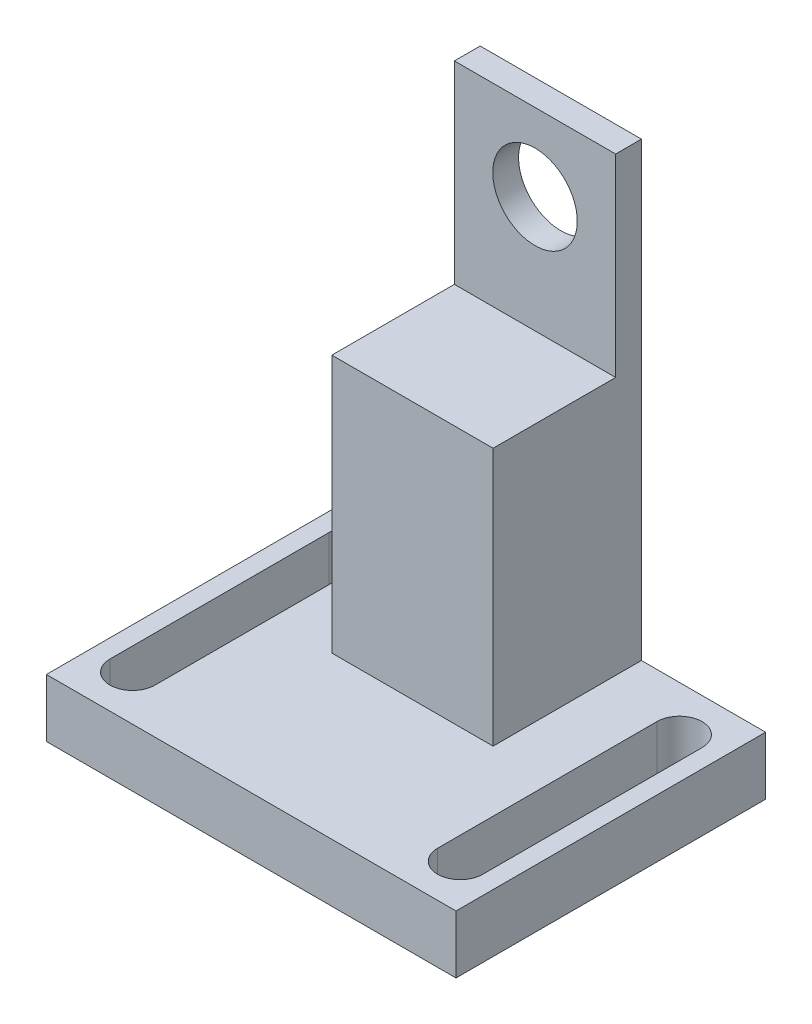
ISO-10303-21;
HEADER;
FILE_DESCRIPTION(('STEP AP214'),'2;1');
FILE_NAME('part.step','',(''),(''),'','','');
FILE_SCHEMA(('AUTOMOTIVE_DESIGN { 1 0 10303 214 1 1 1 1 }'));
ENDSEC;
DATA;
#1=APPLICATION_CONTEXT('core data for automotive mechanical design processes');
#2=APPLICATION_PROTOCOL_DEFINITION('international standard','automotive_design',2000,#1);
#3=PRODUCT_CONTEXT('',#1,'mechanical');
#4=PRODUCT('Part','Part','',(#3));
#5=PRODUCT_RELATED_PRODUCT_CATEGORY('part','',(#4));
#6=PRODUCT_DEFINITION_FORMATION('','',#4);
#7=PRODUCT_DEFINITION_CONTEXT('part definition',#1,'design');
#8=PRODUCT_DEFINITION('design','',#6,#7);
#9=PRODUCT_DEFINITION_SHAPE('','',#8);
#10=(LENGTH_UNIT() NAMED_UNIT(*) SI_UNIT(.MILLI.,.METRE.));
#11=(NAMED_UNIT(*) PLANE_ANGLE_UNIT() SI_UNIT($,.RADIAN.));
#12=(NAMED_UNIT(*) SI_UNIT($,.STERADIAN.) SOLID_ANGLE_UNIT());
#13=UNCERTAINTY_MEASURE_WITH_UNIT(LENGTH_MEASURE(1.E-05),#10,'distance_accuracy_value','');
#14=(GEOMETRIC_REPRESENTATION_CONTEXT(3) GLOBAL_UNCERTAINTY_ASSIGNED_CONTEXT((#13)) GLOBAL_UNIT_ASSIGNED_CONTEXT((#10,
#11,#12)) REPRESENTATION_CONTEXT('',''));
#15=CARTESIAN_POINT('',(0.,0.,0.));
#16=DIRECTION('',(0.,0.,1.));
#17=DIRECTION('',(1.,0.,0.));
#18=AXIS2_PLACEMENT_3D('',#15,#16,#17);
#19=CARTESIAN_POINT('',(-12.5,-58.,11.5));
#20=DIRECTION('',(0.,0.,-1.));
#21=DIRECTION('',(-1.,0.,0.));
#22=AXIS2_PLACEMENT_3D('',#19,#20,#21);
#23=PLANE('',#22);
#24=DIRECTION('',(-1.,0.,0.));
#25=VECTOR('',#24,1.);
#26=CARTESIAN_POINT('',(-31.75,-58.,11.5));
#27=LINE('',#26,#25);
#28=CARTESIAN_POINT('',(12.5,-58.,11.5));
#29=VERTEX_POINT('',#28);
#30=CARTESIAN_POINT('',(-12.5,-58.,11.5));
#31=VERTEX_POINT('',#30);
#32=EDGE_CURVE('E280',#29,#31,#27,.T.);
#33=ORIENTED_EDGE('',*,*,#32,.F.);
#34=DIRECTION('',(0.,1.,0.));
#35=VECTOR('',#34,1.);
#36=CARTESIAN_POINT('',(12.5,12.,11.5));
#37=LINE('',#36,#35);
#38=CARTESIAN_POINT('',(12.5,-18.,11.5));
#39=VERTEX_POINT('',#38);
#40=EDGE_CURVE('E259',#29,#39,#37,.T.);
#41=ORIENTED_EDGE('',*,*,#40,.T.);
#42=DIRECTION('',(-1.,0.,0.));
#43=VECTOR('',#42,1.);
#44=CARTESIAN_POINT('',(31.75,-18.,11.5));
#45=LINE('',#44,#43);
#46=CARTESIAN_POINT('',(-12.5,-18.,11.5));
#47=VERTEX_POINT('',#46);
#48=EDGE_CURVE('E223',#39,#47,#45,.T.);
#49=ORIENTED_EDGE('',*,*,#48,.T.);
#50=DIRECTION('',(0.,-1.,0.));
#51=VECTOR('',#50,1.);
#52=CARTESIAN_POINT('',(-12.5,12.,11.5));
#53=LINE('',#52,#51);
#54=EDGE_CURVE('E255',#47,#31,#53,.T.);
#55=ORIENTED_EDGE('',*,*,#54,.T.);
#56=EDGE_LOOP('',(#33,#41,#49,#55));
#57=FACE_BOUND('',#56,.T.);
#58=ADVANCED_FACE('F32',(#57),#23,.F.);
#59=CARTESIAN_POINT('',(-12.5,-58.,-11.5));
#60=DIRECTION('',(0.,0.,-1.));
#61=DIRECTION('',(-1.,0.,0.));
#62=AXIS2_PLACEMENT_3D('',#59,#60,#61);
#63=PLANE('',#62);
#64=DIRECTION('',(0.,-1.,0.));
#65=VECTOR('',#64,1.);
#66=CARTESIAN_POINT('',(-12.5,12.,-11.5));
#67=LINE('',#66,#65);
#68=CARTESIAN_POINT('',(-12.5,12.,-11.5));
#69=VERTEX_POINT('',#68);
#70=CARTESIAN_POINT('',(-12.5,-58.,-11.5));
#71=VERTEX_POINT('',#70);
#72=EDGE_CURVE('E236',#69,#71,#67,.T.);
#73=ORIENTED_EDGE('',*,*,#72,.F.);
#74=DIRECTION('',(-1.,0.,0.));
#75=VECTOR('',#74,1.);
#76=CARTESIAN_POINT('',(-12.5,12.,-11.5));
#77=LINE('',#76,#75);
#78=CARTESIAN_POINT('',(12.5,12.,-11.5));
#79=VERTEX_POINT('',#78);
#80=EDGE_CURVE('E252',#79,#69,#77,.T.);
#81=ORIENTED_EDGE('',*,*,#80,.F.);
#82=DIRECTION('',(0.,1.,0.));
#83=VECTOR('',#82,1.);
#84=CARTESIAN_POINT('',(12.5,12.,-11.5));
#85=LINE('',#84,#83);
#86=CARTESIAN_POINT('',(12.5,-58.,-11.5));
#87=VERTEX_POINT('',#86);
#88=EDGE_CURVE('E249',#87,#79,#85,.T.);
#89=ORIENTED_EDGE('',*,*,#88,.F.);
#90=DIRECTION('',(-1.,0.,0.));
#91=VECTOR('',#90,1.);
#92=CARTESIAN_POINT('',(12.5,-58.,-11.5));
#93=LINE('',#92,#91);
#94=CARTESIAN_POINT('',(31.75,-58.,-11.5));
#95=VERTEX_POINT('',#94);
#96=EDGE_CURVE('E247',#95,#87,#93,.T.);
#97=ORIENTED_EDGE('',*,*,#96,.F.);
#98=DIRECTION('',(0.,1.,0.));
#99=VECTOR('',#98,1.);
#100=CARTESIAN_POINT('',(31.75,-58.,-11.5));
#101=LINE('',#100,#99);
#102=CARTESIAN_POINT('',(31.75,-67.,-11.5));
#103=VERTEX_POINT('',#102);
#104=EDGE_CURVE('E245',#103,#95,#101,.T.);
#105=ORIENTED_EDGE('',*,*,#104,.F.);
#106=DIRECTION('',(1.,0.,0.));
#107=VECTOR('',#106,1.);
#108=CARTESIAN_POINT('',(-31.75,-67.,-11.5));
#109=LINE('',#108,#107);
#110=CARTESIAN_POINT('',(-31.75,-67.,-11.5));
#111=VERTEX_POINT('',#110);
#112=EDGE_CURVE('E243',#111,#103,#109,.T.);
#113=ORIENTED_EDGE('',*,*,#112,.F.);
#114=DIRECTION('',(0.,-1.,0.));
#115=VECTOR('',#114,1.);
#116=CARTESIAN_POINT('',(-31.75,-58.,-11.5));
#117=LINE('',#116,#115);
#118=CARTESIAN_POINT('',(-31.75,-58.,-11.5));
#119=VERTEX_POINT('',#118);
#120=EDGE_CURVE('E241',#119,#111,#117,.T.);
#121=ORIENTED_EDGE('',*,*,#120,.F.);
#122=DIRECTION('',(-1.,0.,0.));
#123=VECTOR('',#122,1.);
#124=CARTESIAN_POINT('',(-12.5,-58.,-11.5));
#125=LINE('',#124,#123);
#126=EDGE_CURVE('E239',#71,#119,#125,.T.);
#127=ORIENTED_EDGE('',*,*,#126,.F.);
#128=EDGE_LOOP('',(#73,#81,#89,#97,#105,#113,#121,#127));
#129=FACE_BOUND('',#128,.T.);
#130=CARTESIAN_POINT('',(0.,0.,-11.5));
#131=DIRECTION('',(0.,0.,1.));
#132=DIRECTION('',(1.,0.,0.));
#133=AXIS2_PLACEMENT_3D('',#130,#131,#132);
#134=CIRCLE('',#133,6.55);
#135=CARTESIAN_POINT('',(6.55,0.,-11.5));
#136=VERTEX_POINT('',#135);
#137=EDGE_CURVE('E233',#136,#136,#134,.T.);
#138=ORIENTED_EDGE('',*,*,#137,.T.);
#139=EDGE_LOOP('',(#138));
#140=FACE_BOUND('',#139,.T.);
#141=ADVANCED_FACE('F336',(#129,#140),#63,.T.);
#142=CARTESIAN_POINT('',(-12.5,12.,11.5));
#143=DIRECTION('',(1.,0.,0.));
#144=DIRECTION('',(0.,1.,0.));
#145=AXIS2_PLACEMENT_3D('',#142,#143,#144);
#146=PLANE('',#145);
#147=ORIENTED_EDGE('',*,*,#54,.F.);
#148=DIRECTION('',(0.,0.,1.));
#149=VECTOR('',#148,1.);
#150=CARTESIAN_POINT('',(-12.5,-18.,-7.5));
#151=LINE('',#150,#149);
#152=CARTESIAN_POINT('',(-12.5,-18.,-7.5));
#153=VERTEX_POINT('',#152);
#154=EDGE_CURVE('E220',#153,#47,#151,.T.);
#155=ORIENTED_EDGE('',*,*,#154,.F.);
#156=DIRECTION('',(0.,-1.,0.));
#157=VECTOR('',#156,1.);
#158=CARTESIAN_POINT('',(-12.5,12.,-7.5));
#159=LINE('',#158,#157);
#160=CARTESIAN_POINT('',(-12.5,12.,-7.5));
#161=VERTEX_POINT('',#160);
#162=EDGE_CURVE('E217',#161,#153,#159,.T.);
#163=ORIENTED_EDGE('',*,*,#162,.F.);
#164=DIRECTION('',(0.,0.,-1.));
#165=VECTOR('',#164,1.);
#166=CARTESIAN_POINT('',(-12.5,12.,11.5));
#167=LINE('',#166,#165);
#168=EDGE_CURVE('E256',#161,#69,#167,.T.);
#169=ORIENTED_EDGE('',*,*,#168,.T.);
#170=ORIENTED_EDGE('',*,*,#72,.T.);
#171=DIRECTION('',(0.,0.,-1.));
#172=VECTOR('',#171,1.);
#173=CARTESIAN_POINT('',(-12.5,-58.,11.5));
#174=LINE('',#173,#172);
#175=EDGE_CURVE('E274',#31,#71,#174,.T.);
#176=ORIENTED_EDGE('',*,*,#175,.F.);
#177=EDGE_LOOP('',(#147,#155,#163,#169,#170,#176));
#178=FACE_BOUND('',#177,.T.);
#179=ADVANCED_FACE('F34',(#178),#146,.F.);
#180=CARTESIAN_POINT('',(-31.75,-58.,11.5));
#181=DIRECTION('',(1.,0.,0.));
#182=DIRECTION('',(0.,0.,-1.));
#183=AXIS2_PLACEMENT_3D('',#180,#181,#182);
#184=PLANE('',#183);
#185=ORIENTED_EDGE('',*,*,#120,.T.);
#186=DIRECTION('',(0.,0.,-1.));
#187=VECTOR('',#186,1.);
#188=CARTESIAN_POINT('',(-31.75,-67.,11.5));
#189=LINE('',#188,#187);
#190=CARTESIAN_POINT('',(-31.75,-67.,36.5));
#191=VERTEX_POINT('',#190);
#192=EDGE_CURVE('E268',#191,#111,#189,.T.);
#193=ORIENTED_EDGE('',*,*,#192,.F.);
#194=DIRECTION('',(0.,-1.,0.));
#195=VECTOR('',#194,1.);
#196=CARTESIAN_POINT('',(-31.75,-67.,36.5));
#197=LINE('',#196,#195);
#198=CARTESIAN_POINT('',(-31.75,-58.,36.5));
#199=VERTEX_POINT('',#198);
#200=EDGE_CURVE('E199',#199,#191,#197,.T.);
#201=ORIENTED_EDGE('',*,*,#200,.F.);
#202=DIRECTION('',(0.,0.,-1.));
#203=VECTOR('',#202,1.);
#204=CARTESIAN_POINT('',(-31.75,-58.,11.5));
#205=LINE('',#204,#203);
#206=EDGE_CURVE('E271',#199,#119,#205,.T.);
#207=ORIENTED_EDGE('',*,*,#206,.T.);
#208=EDGE_LOOP('',(#185,#193,#201,#207));
#209=FACE_BOUND('',#208,.T.);
#210=ADVANCED_FACE('F363',(#209),#184,.F.);
#211=CARTESIAN_POINT('',(-31.75,-67.,11.5));
#212=DIRECTION('',(0.,1.,0.));
#213=DIRECTION('',(-1.,0.,0.));
#214=AXIS2_PLACEMENT_3D('',#211,#212,#213);
#215=PLANE('',#214);
#216=DIRECTION('',(0.,0.,1.));
#217=VECTOR('',#216,1.);
#218=CARTESIAN_POINT('',(28.9,-67.,-4.5));
#219=LINE('',#218,#217);
#220=CARTESIAN_POINT('',(28.9,-67.,-4.5));
#221=VERTEX_POINT('',#220);
#222=CARTESIAN_POINT('',(28.9,-67.,29.5));
#223=VERTEX_POINT('',#222);
#224=EDGE_CURVE('E169',#221,#223,#219,.T.);
#225=ORIENTED_EDGE('',*,*,#224,.F.);
#226=CARTESIAN_POINT('',(25.4,-67.,-4.5));
#227=DIRECTION('',(0.,-1.,0.));
#228=DIRECTION('',(1.,0.,0.));
#229=AXIS2_PLACEMENT_3D('',#226,#227,#228);
#230=CIRCLE('',#229,3.5);
#231=CARTESIAN_POINT('',(21.9,-67.,-4.5));
#232=VERTEX_POINT('',#231);
#233=EDGE_CURVE('E47',#232,#221,#230,.T.);
#234=ORIENTED_EDGE('',*,*,#233,.F.);
#235=DIRECTION('',(0.,0.,-1.));
#236=VECTOR('',#235,1.);
#237=CARTESIAN_POINT('',(21.9,-67.,-4.5));
#238=LINE('',#237,#236);
#239=CARTESIAN_POINT('',(21.9,-67.,29.5));
#240=VERTEX_POINT('',#239);
#241=EDGE_CURVE('E176',#240,#232,#238,.T.);
#242=ORIENTED_EDGE('',*,*,#241,.F.);
#243=CARTESIAN_POINT('',(25.4,-67.,29.5));
#244=DIRECTION('',(0.,-1.,0.));
#245=DIRECTION('',(1.,0.,0.));
#246=AXIS2_PLACEMENT_3D('',#243,#244,#245);
#247=CIRCLE('',#246,3.5);
#248=EDGE_CURVE('E160',#223,#240,#247,.T.);
#249=ORIENTED_EDGE('',*,*,#248,.F.);
#250=EDGE_LOOP('',(#225,#234,#242,#249));
#251=FACE_BOUND('',#250,.T.);
#252=DIRECTION('',(0.,0.,-1.));
#253=VECTOR('',#252,1.);
#254=CARTESIAN_POINT('',(-28.9,-67.,29.5));
#255=LINE('',#254,#253);
#256=CARTESIAN_POINT('',(-28.9,-67.,29.5));
#257=VERTEX_POINT('',#256);
#258=CARTESIAN_POINT('',(-28.9,-67.,-4.5));
#259=VERTEX_POINT('',#258);
#260=EDGE_CURVE('E187',#257,#259,#255,.T.);
#261=ORIENTED_EDGE('',*,*,#260,.F.);
#262=CARTESIAN_POINT('',(-25.4,-67.,29.5));
#263=DIRECTION('',(0.,-1.,0.));
#264=DIRECTION('',(1.,0.,0.));
#265=AXIS2_PLACEMENT_3D('',#262,#263,#264);
#266=CIRCLE('',#265,3.5);
#267=CARTESIAN_POINT('',(-21.9,-67.,29.5));
#268=VERTEX_POINT('',#267);
#269=EDGE_CURVE('E183',#268,#257,#266,.T.);
#270=ORIENTED_EDGE('',*,*,#269,.F.);
#271=DIRECTION('',(0.,0.,1.));
#272=VECTOR('',#271,1.);
#273=CARTESIAN_POINT('',(-21.9,-67.,29.5));
#274=LINE('',#273,#272);
#275=CARTESIAN_POINT('',(-21.9,-67.,-4.5));
#276=VERTEX_POINT('',#275);
#277=EDGE_CURVE('E193',#276,#268,#274,.T.);
#278=ORIENTED_EDGE('',*,*,#277,.F.);
#279=CARTESIAN_POINT('',(-25.4,-67.,-4.5));
#280=DIRECTION('',(0.,-1.,0.));
#281=DIRECTION('',(1.,0.,0.));
#282=AXIS2_PLACEMENT_3D('',#279,#280,#281);
#283=CIRCLE('',#282,3.5);
#284=EDGE_CURVE('E190',#259,#276,#283,.T.);
#285=ORIENTED_EDGE('',*,*,#284,.F.);
#286=EDGE_LOOP('',(#261,#270,#278,#285));
#287=FACE_BOUND('',#286,.T.);
#288=ORIENTED_EDGE('',*,*,#112,.T.);
#289=DIRECTION('',(0.,0.,-1.));
#290=VECTOR('',#289,1.);
#291=CARTESIAN_POINT('',(31.75,-67.,11.5));
#292=LINE('',#291,#290);
#293=CARTESIAN_POINT('',(31.75,-67.,36.5));
#294=VERTEX_POINT('',#293);
#295=EDGE_CURVE('E265',#294,#103,#292,.T.);
#296=ORIENTED_EDGE('',*,*,#295,.F.);
#297=DIRECTION('',(1.,0.,0.));
#298=VECTOR('',#297,1.);
#299=CARTESIAN_POINT('',(-31.75,-67.,36.5));
#300=LINE('',#299,#298);
#301=EDGE_CURVE('E208',#191,#294,#300,.T.);
#302=ORIENTED_EDGE('',*,*,#301,.F.);
#303=ORIENTED_EDGE('',*,*,#192,.T.);
#304=EDGE_LOOP('',(#288,#296,#302,#303));
#305=FACE_BOUND('',#304,.T.);
#306=ADVANCED_FACE('F173',(#251,#287,#305),#215,.F.);
#307=CARTESIAN_POINT('',(31.75,-58.,11.5));
#308=DIRECTION('',(-1.,0.,0.));
#309=DIRECTION('',(0.,0.,1.));
#310=AXIS2_PLACEMENT_3D('',#307,#308,#309);
#311=PLANE('',#310);
#312=ORIENTED_EDGE('',*,*,#104,.T.);
#313=DIRECTION('',(0.,0.,-1.));
#314=VECTOR('',#313,1.);
#315=CARTESIAN_POINT('',(31.75,-58.,11.5));
#316=LINE('',#315,#314);
#317=CARTESIAN_POINT('',(31.75,-58.,36.5));
#318=VERTEX_POINT('',#317);
#319=EDGE_CURVE('E262',#318,#95,#316,.T.);
#320=ORIENTED_EDGE('',*,*,#319,.F.);
#321=DIRECTION('',(0.,1.,0.));
#322=VECTOR('',#321,1.);
#323=CARTESIAN_POINT('',(31.75,-67.,36.5));
#324=LINE('',#323,#322);
#325=EDGE_CURVE('E211',#294,#318,#324,.T.);
#326=ORIENTED_EDGE('',*,*,#325,.F.);
#327=ORIENTED_EDGE('',*,*,#295,.T.);
#328=EDGE_LOOP('',(#312,#320,#326,#327));
#329=FACE_BOUND('',#328,.T.);
#330=ADVANCED_FACE('F358',(#329),#311,.F.);
#331=CARTESIAN_POINT('',(12.5,-58.,11.5));
#332=DIRECTION('',(0.,-1.,0.));
#333=DIRECTION('',(0.,0.,-1.));
#334=AXIS2_PLACEMENT_3D('',#331,#332,#333);
#335=PLANE('',#334);
#336=DIRECTION('',(0.,0.,-1.));
#337=VECTOR('',#336,1.);
#338=CARTESIAN_POINT('',(21.9,-58.,11.5));
#339=LINE('',#338,#337);
#340=CARTESIAN_POINT('',(21.9,-58.,29.5));
#341=VERTEX_POINT('',#340);
#342=CARTESIAN_POINT('',(21.9,-58.,-4.5));
#343=VERTEX_POINT('',#342);
#344=EDGE_CURVE('E40',#341,#343,#339,.T.);
#345=ORIENTED_EDGE('',*,*,#344,.T.);
#346=CARTESIAN_POINT('',(25.4,-58.,-4.5));
#347=DIRECTION('',(0.,-1.,0.));
#348=DIRECTION('',(0.,0.,-1.));
#349=AXIS2_PLACEMENT_3D('',#346,#347,#348);
#350=CIRCLE('',#349,3.5);
#351=CARTESIAN_POINT('',(28.9,-58.,-4.5));
#352=VERTEX_POINT('',#351);
#353=EDGE_CURVE('E11',#343,#352,#350,.T.);
#354=ORIENTED_EDGE('',*,*,#353,.T.);
#355=DIRECTION('',(0.,0.,1.));
#356=VECTOR('',#355,1.);
#357=CARTESIAN_POINT('',(28.9,-58.,11.5));
#358=LINE('',#357,#356);
#359=CARTESIAN_POINT('',(28.9,-58.,29.5));
#360=VERTEX_POINT('',#359);
#361=EDGE_CURVE('E312',#352,#360,#358,.T.);
#362=ORIENTED_EDGE('',*,*,#361,.T.);
#363=CARTESIAN_POINT('',(25.4,-58.,29.5));
#364=DIRECTION('',(0.,-1.,0.));
#365=DIRECTION('',(0.,0.,-1.));
#366=AXIS2_PLACEMENT_3D('',#363,#364,#365);
#367=CIRCLE('',#366,3.5);
#368=EDGE_CURVE('E163',#360,#341,#367,.T.);
#369=ORIENTED_EDGE('',*,*,#368,.T.);
#370=EDGE_LOOP('',(#345,#354,#362,#369));
#371=FACE_BOUND('',#370,.T.);
#372=DIRECTION('',(0.,0.,1.));
#373=VECTOR('',#372,1.);
#374=CARTESIAN_POINT('',(-21.9,-58.,11.5));
#375=LINE('',#374,#373);
#376=CARTESIAN_POINT('',(-21.9,-58.,-4.5));
#377=VERTEX_POINT('',#376);
#378=CARTESIAN_POINT('',(-21.9,-58.,29.5));
#379=VERTEX_POINT('',#378);
#380=EDGE_CURVE('E306',#377,#379,#375,.T.);
#381=ORIENTED_EDGE('',*,*,#380,.T.);
#382=CARTESIAN_POINT('',(-25.4,-58.,29.5));
#383=DIRECTION('',(0.,-1.,0.));
#384=DIRECTION('',(0.,0.,-1.));
#385=AXIS2_PLACEMENT_3D('',#382,#383,#384);
#386=CIRCLE('',#385,3.5);
#387=CARTESIAN_POINT('',(-28.9,-58.,29.5));
#388=VERTEX_POINT('',#387);
#389=EDGE_CURVE('E309',#379,#388,#386,.T.);
#390=ORIENTED_EDGE('',*,*,#389,.T.);
#391=DIRECTION('',(0.,0.,-1.));
#392=VECTOR('',#391,1.);
#393=CARTESIAN_POINT('',(-28.9,-58.,11.5));
#394=LINE('',#393,#392);
#395=CARTESIAN_POINT('',(-28.9,-58.,-4.5));
#396=VERTEX_POINT('',#395);
#397=EDGE_CURVE('E285',#388,#396,#394,.T.);
#398=ORIENTED_EDGE('',*,*,#397,.T.);
#399=CARTESIAN_POINT('',(-25.4,-58.,-4.5));
#400=DIRECTION('',(0.,-1.,0.));
#401=DIRECTION('',(0.,0.,-1.));
#402=AXIS2_PLACEMENT_3D('',#399,#400,#401);
#403=CIRCLE('',#402,3.5);
#404=EDGE_CURVE('E303',#396,#377,#403,.T.);
#405=ORIENTED_EDGE('',*,*,#404,.T.);
#406=EDGE_LOOP('',(#381,#390,#398,#405));
#407=FACE_BOUND('',#406,.T.);
#408=ORIENTED_EDGE('',*,*,#96,.T.);
#409=DIRECTION('',(0.,0.,-1.));
#410=VECTOR('',#409,1.);
#411=CARTESIAN_POINT('',(12.5,-58.,11.5));
#412=LINE('',#411,#410);
#413=EDGE_CURVE('E261',#29,#87,#412,.T.);
#414=ORIENTED_EDGE('',*,*,#413,.F.);
#415=ORIENTED_EDGE('',*,*,#32,.T.);
#416=ORIENTED_EDGE('',*,*,#175,.T.);
#417=ORIENTED_EDGE('',*,*,#126,.T.);
#418=ORIENTED_EDGE('',*,*,#206,.F.);
#419=DIRECTION('',(-1.,0.,0.));
#420=VECTOR('',#419,1.);
#421=CARTESIAN_POINT('',(-31.75,-58.,36.5));
#422=LINE('',#421,#420);
#423=EDGE_CURVE('E214',#318,#199,#422,.T.);
#424=ORIENTED_EDGE('',*,*,#423,.F.);
#425=ORIENTED_EDGE('',*,*,#319,.T.);
#426=EDGE_LOOP('',(#408,#414,#415,#416,#417,#418,#424,#425));
#427=FACE_BOUND('',#426,.T.);
#428=ADVANCED_FACE('F316',(#371,#407,#427),#335,.F.);
#429=CARTESIAN_POINT('',(12.5,12.,11.5));
#430=DIRECTION('',(-1.,0.,0.));
#431=DIRECTION('',(0.,-1.,0.));
#432=AXIS2_PLACEMENT_3D('',#429,#430,#431);
#433=PLANE('',#432);
#434=DIRECTION('',(0.,-1.,0.));
#435=VECTOR('',#434,1.);
#436=CARTESIAN_POINT('',(12.5,12.,-7.5));
#437=LINE('',#436,#435);
#438=CARTESIAN_POINT('',(12.5,12.,-7.5));
#439=VERTEX_POINT('',#438);
#440=CARTESIAN_POINT('',(12.5,-18.,-7.5));
#441=VERTEX_POINT('',#440);
#442=EDGE_CURVE('E230',#439,#441,#437,.T.);
#443=ORIENTED_EDGE('',*,*,#442,.T.);
#444=DIRECTION('',(0.,0.,1.));
#445=VECTOR('',#444,1.);
#446=CARTESIAN_POINT('',(12.5,-18.,11.5));
#447=LINE('',#446,#445);
#448=EDGE_CURVE('E277',#441,#39,#447,.T.);
#449=ORIENTED_EDGE('',*,*,#448,.T.);
#450=ORIENTED_EDGE('',*,*,#40,.F.);
#451=ORIENTED_EDGE('',*,*,#413,.T.);
#452=ORIENTED_EDGE('',*,*,#88,.T.);
#453=DIRECTION('',(0.,0.,-1.));
#454=VECTOR('',#453,1.);
#455=CARTESIAN_POINT('',(12.5,12.,11.5));
#456=LINE('',#455,#454);
#457=EDGE_CURVE('E258',#439,#79,#456,.T.);
#458=ORIENTED_EDGE('',*,*,#457,.F.);
#459=EDGE_LOOP('',(#443,#449,#450,#451,#452,#458));
#460=FACE_BOUND('',#459,.T.);
#461=ADVANCED_FACE('F351',(#460),#433,.F.);
#462=CARTESIAN_POINT('',(-12.5,12.,11.5));
#463=DIRECTION('',(0.,-1.,0.));
#464=DIRECTION('',(1.,0.,0.));
#465=AXIS2_PLACEMENT_3D('',#462,#463,#464);
#466=PLANE('',#465);
#467=ORIENTED_EDGE('',*,*,#168,.F.);
#468=DIRECTION('',(-1.,0.,0.));
#469=VECTOR('',#468,1.);
#470=CARTESIAN_POINT('',(31.75,12.,-7.5));
#471=LINE('',#470,#469);
#472=EDGE_CURVE('E222',#439,#161,#471,.T.);
#473=ORIENTED_EDGE('',*,*,#472,.F.);
#474=ORIENTED_EDGE('',*,*,#457,.T.);
#475=ORIENTED_EDGE('',*,*,#80,.T.);
#476=EDGE_LOOP('',(#467,#473,#474,#475));
#477=FACE_BOUND('',#476,.T.);
#478=ADVANCED_FACE('F348',(#477),#466,.F.);
#479=CARTESIAN_POINT('',(0.,0.,11.5));
#480=DIRECTION('',(0.,0.,-1.));
#481=DIRECTION('',(-1.,0.,0.));
#482=AXIS2_PLACEMENT_3D('',#479,#480,#481);
#483=CYLINDRICAL_SURFACE('',#482,6.55);
#484=CARTESIAN_POINT('',(0.,0.,-7.5));
#485=DIRECTION('',(0.,0.,-1.));
#486=DIRECTION('',(0.,1.,0.));
#487=AXIS2_PLACEMENT_3D('',#484,#485,#486);
#488=CIRCLE('',#487,6.55);
#489=CARTESIAN_POINT('',(0.,6.55,-7.5));
#490=VERTEX_POINT('',#489);
#491=EDGE_CURVE('E226',#490,#490,#488,.T.);
#492=ORIENTED_EDGE('',*,*,#491,.F.);
#493=EDGE_LOOP('',(#492));
#494=FACE_BOUND('',#493,.T.);
#495=ORIENTED_EDGE('',*,*,#137,.F.);
#496=EDGE_LOOP('',(#495));
#497=FACE_BOUND('',#496,.T.);
#498=ADVANCED_FACE('F345',(#494,#497),#483,.F.);
#499=CARTESIAN_POINT('',(31.75,-18.,-7.5));
#500=DIRECTION('',(0.,-1.,0.));
#501=DIRECTION('',(0.,0.,-1.));
#502=AXIS2_PLACEMENT_3D('',#499,#500,#501);
#503=PLANE('',#502);
#504=DIRECTION('',(-1.,0.,0.));
#505=VECTOR('',#504,1.);
#506=CARTESIAN_POINT('',(31.75,-18.,-7.5));
#507=LINE('',#506,#505);
#508=EDGE_CURVE('E227',#441,#153,#507,.T.);
#509=ORIENTED_EDGE('',*,*,#508,.T.);
#510=ORIENTED_EDGE('',*,*,#154,.T.);
#511=ORIENTED_EDGE('',*,*,#48,.F.);
#512=ORIENTED_EDGE('',*,*,#448,.F.);
#513=EDGE_LOOP('',(#509,#510,#511,#512));
#514=FACE_BOUND('',#513,.T.);
#515=ADVANCED_FACE('F397',(#514),#503,.F.);
#516=CARTESIAN_POINT('',(31.75,12.,-7.5));
#517=DIRECTION('',(0.,0.,-1.));
#518=DIRECTION('',(0.,1.,0.));
#519=AXIS2_PLACEMENT_3D('',#516,#517,#518);
#520=PLANE('',#519);
#521=ORIENTED_EDGE('',*,*,#491,.T.);
#522=EDGE_LOOP('',(#521));
#523=FACE_BOUND('',#522,.T.);
#524=ORIENTED_EDGE('',*,*,#472,.T.);
#525=ORIENTED_EDGE('',*,*,#162,.T.);
#526=ORIENTED_EDGE('',*,*,#508,.F.);
#527=ORIENTED_EDGE('',*,*,#442,.F.);
#528=EDGE_LOOP('',(#524,#525,#526,#527));
#529=FACE_BOUND('',#528,.T.);
#530=ADVANCED_FACE('F388',(#523,#529),#520,.F.);
#531=CARTESIAN_POINT('',(-31.75,-58.,36.5));
#532=DIRECTION('',(0.,0.,-1.));
#533=DIRECTION('',(-1.,0.,0.));
#534=AXIS2_PLACEMENT_3D('',#531,#532,#533);
#535=PLANE('',#534);
#536=ORIENTED_EDGE('',*,*,#200,.T.);
#537=ORIENTED_EDGE('',*,*,#301,.T.);
#538=ORIENTED_EDGE('',*,*,#325,.T.);
#539=ORIENTED_EDGE('',*,*,#423,.T.);
#540=EDGE_LOOP('',(#536,#537,#538,#539));
#541=FACE_BOUND('',#540,.T.);
#542=ADVANCED_FACE('F385',(#541),#535,.F.);
#543=CARTESIAN_POINT('',(-25.4,12.,29.5));
#544=DIRECTION('',(0.,-1.,0.));
#545=DIRECTION('',(1.,0.,0.));
#546=AXIS2_PLACEMENT_3D('',#543,#544,#545);
#547=CYLINDRICAL_SURFACE('',#546,3.5);
#548=DIRECTION('',(0.,-1.,0.));
#549=VECTOR('',#548,1.);
#550=CARTESIAN_POINT('',(-21.9,12.,29.5));
#551=LINE('',#550,#549);
#552=EDGE_CURVE('E197',#379,#268,#551,.T.);
#553=ORIENTED_EDGE('',*,*,#552,.T.);
#554=ORIENTED_EDGE('',*,*,#269,.T.);
#555=DIRECTION('',(0.,-1.,0.));
#556=VECTOR('',#555,1.);
#557=CARTESIAN_POINT('',(-28.9,12.,29.5));
#558=LINE('',#557,#556);
#559=EDGE_CURVE('E196',#388,#257,#558,.T.);
#560=ORIENTED_EDGE('',*,*,#559,.F.);
#561=ORIENTED_EDGE('',*,*,#389,.F.);
#562=EDGE_LOOP('',(#553,#554,#560,#561));
#563=FACE_BOUND('',#562,.T.);
#564=ADVANCED_FACE('F387',(#563),#547,.F.);
#565=CARTESIAN_POINT('',(-21.9,12.,29.5));
#566=DIRECTION('',(1.,0.,0.));
#567=DIRECTION('',(0.,0.,-1.));
#568=AXIS2_PLACEMENT_3D('',#565,#566,#567);
#569=PLANE('',#568);
#570=DIRECTION('',(0.,-1.,0.));
#571=VECTOR('',#570,1.);
#572=CARTESIAN_POINT('',(-21.9,12.,-4.5));
#573=LINE('',#572,#571);
#574=EDGE_CURVE('E200',#377,#276,#573,.T.);
#575=ORIENTED_EDGE('',*,*,#574,.T.);
#576=ORIENTED_EDGE('',*,*,#277,.T.);
#577=ORIENTED_EDGE('',*,*,#552,.F.);
#578=ORIENTED_EDGE('',*,*,#380,.F.);
#579=EDGE_LOOP('',(#575,#576,#577,#578));
#580=FACE_BOUND('',#579,.T.);
#581=ADVANCED_FACE('F394',(#580),#569,.F.);
#582=CARTESIAN_POINT('',(-25.4,12.,-4.5));
#583=DIRECTION('',(0.,-1.,0.));
#584=DIRECTION('',(1.,0.,0.));
#585=AXIS2_PLACEMENT_3D('',#582,#583,#584);
#586=CYLINDRICAL_SURFACE('',#585,3.5);
#587=DIRECTION('',(0.,-1.,0.));
#588=VECTOR('',#587,1.);
#589=CARTESIAN_POINT('',(-28.9,12.,-4.5));
#590=LINE('',#589,#588);
#591=EDGE_CURVE('E202',#396,#259,#590,.T.);
#592=ORIENTED_EDGE('',*,*,#591,.T.);
#593=ORIENTED_EDGE('',*,*,#284,.T.);
#594=ORIENTED_EDGE('',*,*,#574,.F.);
#595=ORIENTED_EDGE('',*,*,#404,.F.);
#596=EDGE_LOOP('',(#592,#593,#594,#595));
#597=FACE_BOUND('',#596,.T.);
#598=ADVANCED_FACE('F330',(#597),#586,.F.);
#599=CARTESIAN_POINT('',(-28.9,12.,29.5));
#600=DIRECTION('',(-1.,0.,0.));
#601=DIRECTION('',(0.,0.,1.));
#602=AXIS2_PLACEMENT_3D('',#599,#600,#601);
#603=PLANE('',#602);
#604=ORIENTED_EDGE('',*,*,#559,.T.);
#605=ORIENTED_EDGE('',*,*,#260,.T.);
#606=ORIENTED_EDGE('',*,*,#591,.F.);
#607=ORIENTED_EDGE('',*,*,#397,.F.);
#608=EDGE_LOOP('',(#604,#605,#606,#607));
#609=FACE_BOUND('',#608,.T.);
#610=ADVANCED_FACE('F323',(#609),#603,.F.);
#611=CARTESIAN_POINT('',(25.4,12.,-4.5));
#612=DIRECTION('',(0.,-1.,0.));
#613=DIRECTION('',(1.,0.,0.));
#614=AXIS2_PLACEMENT_3D('',#611,#612,#613);
#615=CYLINDRICAL_SURFACE('',#614,3.5);
#616=DIRECTION('',(0.,-1.,0.));
#617=VECTOR('',#616,1.);
#618=CARTESIAN_POINT('',(21.9,12.,-4.5));
#619=LINE('',#618,#617);
#620=EDGE_CURVE('E181',#343,#232,#619,.T.);
#621=ORIENTED_EDGE('',*,*,#620,.T.);
#622=ORIENTED_EDGE('',*,*,#233,.T.);
#623=DIRECTION('',(0.,-1.,0.));
#624=VECTOR('',#623,1.);
#625=CARTESIAN_POINT('',(28.9,12.,-4.5));
#626=LINE('',#625,#624);
#627=EDGE_CURVE('E166',#352,#221,#626,.T.);
#628=ORIENTED_EDGE('',*,*,#627,.F.);
#629=ORIENTED_EDGE('',*,*,#353,.F.);
#630=EDGE_LOOP('',(#621,#622,#628,#629));
#631=FACE_BOUND('',#630,.T.);
#632=ADVANCED_FACE('F321',(#631),#615,.F.);
#633=CARTESIAN_POINT('',(21.9,12.,-4.5));
#634=DIRECTION('',(-1.,0.,0.));
#635=DIRECTION('',(0.,0.,1.));
#636=AXIS2_PLACEMENT_3D('',#633,#634,#635);
#637=PLANE('',#636);
#638=DIRECTION('',(0.,-1.,0.));
#639=VECTOR('',#638,1.);
#640=CARTESIAN_POINT('',(21.9,12.,29.5));
#641=LINE('',#640,#639);
#642=EDGE_CURVE('E165',#341,#240,#641,.T.);
#643=ORIENTED_EDGE('',*,*,#642,.T.);
#644=ORIENTED_EDGE('',*,*,#241,.T.);
#645=ORIENTED_EDGE('',*,*,#620,.F.);
#646=ORIENTED_EDGE('',*,*,#344,.F.);
#647=EDGE_LOOP('',(#643,#644,#645,#646));
#648=FACE_BOUND('',#647,.T.);
#649=ADVANCED_FACE('F320',(#648),#637,.F.);
#650=CARTESIAN_POINT('',(25.4,12.,29.5));
#651=DIRECTION('',(0.,-1.,0.));
#652=DIRECTION('',(1.,0.,0.));
#653=AXIS2_PLACEMENT_3D('',#650,#651,#652);
#654=CYLINDRICAL_SURFACE('',#653,3.5);
#655=DIRECTION('',(0.,-1.,0.));
#656=VECTOR('',#655,1.);
#657=CARTESIAN_POINT('',(28.9,12.,29.5));
#658=LINE('',#657,#656);
#659=EDGE_CURVE('E55',#360,#223,#658,.T.);
#660=ORIENTED_EDGE('',*,*,#659,.T.);
#661=ORIENTED_EDGE('',*,*,#248,.T.);
#662=ORIENTED_EDGE('',*,*,#642,.F.);
#663=ORIENTED_EDGE('',*,*,#368,.F.);
#664=EDGE_LOOP('',(#660,#661,#662,#663));
#665=FACE_BOUND('',#664,.T.);
#666=ADVANCED_FACE('F157',(#665),#654,.F.);
#667=CARTESIAN_POINT('',(28.9,12.,-4.5));
#668=DIRECTION('',(1.,0.,0.));
#669=DIRECTION('',(0.,0.,-1.));
#670=AXIS2_PLACEMENT_3D('',#667,#668,#669);
#671=PLANE('',#670);
#672=ORIENTED_EDGE('',*,*,#627,.T.);
#673=ORIENTED_EDGE('',*,*,#224,.T.);
#674=ORIENTED_EDGE('',*,*,#659,.F.);
#675=ORIENTED_EDGE('',*,*,#361,.F.);
#676=EDGE_LOOP('',(#672,#673,#674,#675));
#677=FACE_BOUND('',#676,.T.);
#678=ADVANCED_FACE('F170',(#677),#671,.F.);
#679=CLOSED_SHELL('',(#58,#141,#179,#210,#306,#330,#428,#461,#478,#498,#515,#530,#542,#564,#581,
#598,#610,#632,#649,#666,#678));
#680=MANIFOLD_SOLID_BREP('B2',#679);
#681=ADVANCED_BREP_SHAPE_REPRESENTATION('',(#18,#680),#14);
#682=SHAPE_DEFINITION_REPRESENTATION(#9,#681);
ENDSEC;
END-ISO-10303-21;
